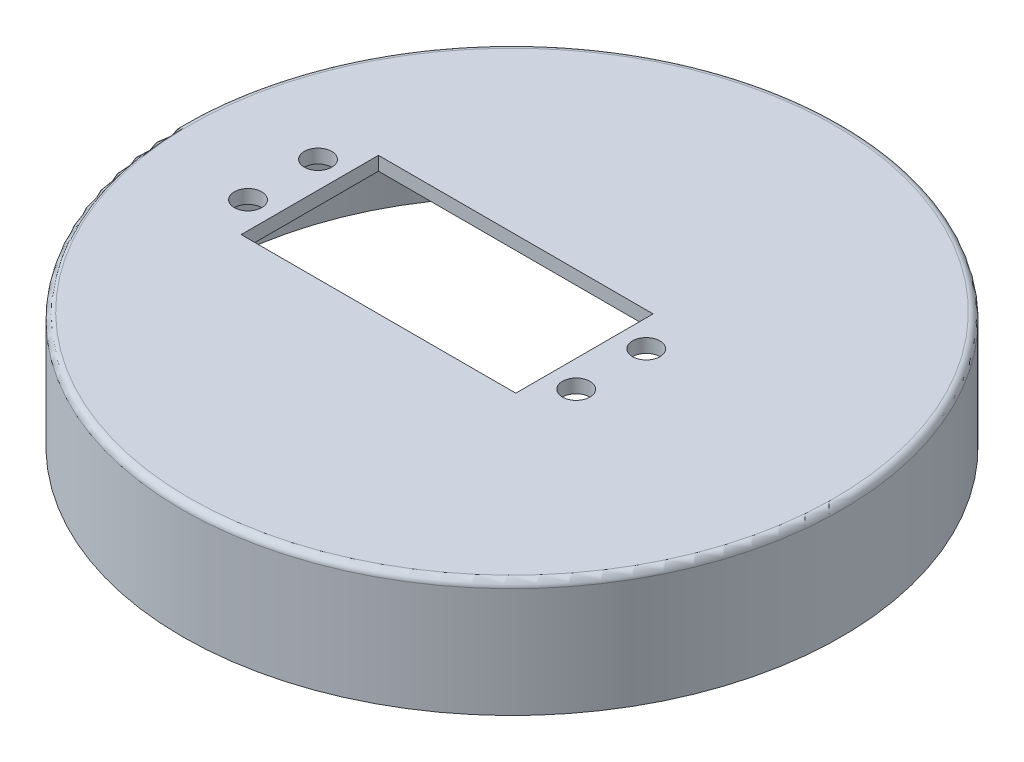
ISO-10303-21;
HEADER;
FILE_DESCRIPTION(('STEP AP214'),'2;1');
FILE_NAME('part.step','',(''),(''),'','','');
FILE_SCHEMA(('AUTOMOTIVE_DESIGN { 1 0 10303 214 1 1 1 1 }'));
ENDSEC;
DATA;
#1=APPLICATION_CONTEXT('core data for automotive mechanical design processes');
#2=APPLICATION_PROTOCOL_DEFINITION('international standard','automotive_design',2000,#1);
#3=PRODUCT_CONTEXT('',#1,'mechanical');
#4=PRODUCT('Part','Part','',(#3));
#5=PRODUCT_RELATED_PRODUCT_CATEGORY('part','',(#4));
#6=PRODUCT_DEFINITION_FORMATION('','',#4);
#7=PRODUCT_DEFINITION_CONTEXT('part definition',#1,'design');
#8=PRODUCT_DEFINITION('design','',#6,#7);
#9=PRODUCT_DEFINITION_SHAPE('','',#8);
#10=(LENGTH_UNIT() NAMED_UNIT(*) SI_UNIT(.MILLI.,.METRE.));
#11=(NAMED_UNIT(*) PLANE_ANGLE_UNIT() SI_UNIT($,.RADIAN.));
#12=(NAMED_UNIT(*) SI_UNIT($,.STERADIAN.) SOLID_ANGLE_UNIT());
#13=UNCERTAINTY_MEASURE_WITH_UNIT(LENGTH_MEASURE(1.E-05),#10,'distance_accuracy_value','');
#14=(GEOMETRIC_REPRESENTATION_CONTEXT(3) GLOBAL_UNCERTAINTY_ASSIGNED_CONTEXT((#13)) GLOBAL_UNIT_ASSIGNED_CONTEXT((#10,
#11,#12)) REPRESENTATION_CONTEXT('',''));
#15=CARTESIAN_POINT('',(0.,0.,0.));
#16=DIRECTION('',(0.,0.,1.));
#17=DIRECTION('',(1.,0.,0.));
#18=AXIS2_PLACEMENT_3D('',#15,#16,#17);
#19=CARTESIAN_POINT('',(0.,0.,0.));
#20=DIRECTION('',(0.,1.,0.));
#21=DIRECTION('',(0.,0.,1.));
#22=AXIS2_PLACEMENT_3D('',#19,#20,#21);
#23=PLANE('',#22);
#24=CARTESIAN_POINT('',(-33.3488657899991,0.,5.09860840999997));
#25=DIRECTION('',(0.,1.,0.));
#26=DIRECTION('',(0.,0.,1.));
#27=AXIS2_PLACEMENT_3D('',#24,#25,#26);
#28=CIRCLE('',#27,2.);
#29=CARTESIAN_POINT('',(-33.3488657899991,0.,7.09860840999997));
#30=VERTEX_POINT('',#29);
#31=EDGE_CURVE('E306',#30,#30,#28,.T.);
#32=ORIENTED_EDGE('',*,*,#31,.T.);
#33=EDGE_LOOP('',(#32));
#34=FACE_BOUND('',#33,.T.);
#35=CARTESIAN_POINT('',(-33.3488657899991,0.,-5.09860840999996));
#36=DIRECTION('',(0.,1.,0.));
#37=DIRECTION('',(0.,0.,1.));
#38=AXIS2_PLACEMENT_3D('',#35,#36,#37);
#39=CIRCLE('',#38,2.);
#40=CARTESIAN_POINT('',(-33.3488657899991,0.,-3.09860840999996));
#41=VERTEX_POINT('',#40);
#42=EDGE_CURVE('E308',#41,#41,#39,.F.);
#43=ORIENTED_EDGE('',*,*,#42,.F.);
#44=EDGE_LOOP('',(#43));
#45=FACE_BOUND('',#44,.T.);
#46=CARTESIAN_POINT('',(14.4488657899991,0.,5.09860840999996));
#47=DIRECTION('',(0.,1.,0.));
#48=DIRECTION('',(0.,0.,1.));
#49=AXIS2_PLACEMENT_3D('',#46,#47,#48);
#50=CIRCLE('',#49,2.);
#51=CARTESIAN_POINT('',(14.4488657899991,0.,7.09860840999997));
#52=VERTEX_POINT('',#51);
#53=EDGE_CURVE('E313',#52,#52,#50,.F.);
#54=ORIENTED_EDGE('',*,*,#53,.F.);
#55=EDGE_LOOP('',(#54));
#56=FACE_BOUND('',#55,.T.);
#57=CARTESIAN_POINT('',(0.,0.,0.));
#58=DIRECTION('',(0.,1.,0.));
#59=DIRECTION('',(0.,0.,1.));
#60=AXIS2_PLACEMENT_3D('',#57,#58,#59);
#61=CIRCLE('',#60,43.5);
#62=CARTESIAN_POINT('',(0.,0.,43.5));
#63=VERTEX_POINT('',#62);
#64=EDGE_CURVE('E134',#63,#63,#61,.F.);
#65=ORIENTED_EDGE('',*,*,#64,.T.);
#66=EDGE_LOOP('',(#65));
#67=FACE_BOUND('',#66,.T.);
#68=DIRECTION('',(1.,0.,0.));
#69=VECTOR('',#68,1.);
#70=CARTESIAN_POINT('',(0.,0.,-10.));
#71=LINE('',#70,#69);
#72=CARTESIAN_POINT('',(-29.45,0.,-10.));
#73=VERTEX_POINT('',#72);
#74=CARTESIAN_POINT('',(10.55,0.,-10.));
#75=VERTEX_POINT('',#74);
#76=EDGE_CURVE('E123',#73,#75,#71,.T.);
#77=ORIENTED_EDGE('',*,*,#76,.F.);
#78=DIRECTION('',(0.,0.,1.));
#79=VECTOR('',#78,1.);
#80=CARTESIAN_POINT('',(-29.45,0.,0.));
#81=LINE('',#80,#79);
#82=CARTESIAN_POINT('',(-29.45,0.,10.));
#83=VERTEX_POINT('',#82);
#84=EDGE_CURVE('E115',#73,#83,#81,.T.);
#85=ORIENTED_EDGE('',*,*,#84,.T.);
#86=DIRECTION('',(1.,0.,0.));
#87=VECTOR('',#86,1.);
#88=CARTESIAN_POINT('',(0.,0.,10.));
#89=LINE('',#88,#87);
#90=CARTESIAN_POINT('',(10.55,0.,10.));
#91=VERTEX_POINT('',#90);
#92=EDGE_CURVE('E95',#83,#91,#89,.T.);
#93=ORIENTED_EDGE('',*,*,#92,.T.);
#94=DIRECTION('',(0.,0.,-1.));
#95=VECTOR('',#94,1.);
#96=CARTESIAN_POINT('',(10.55,0.,0.));
#97=LINE('',#96,#95);
#98=EDGE_CURVE('E120',#91,#75,#97,.T.);
#99=ORIENTED_EDGE('',*,*,#98,.T.);
#100=EDGE_LOOP('',(#77,#85,#93,#99));
#101=FACE_BOUND('',#100,.T.);
#102=CARTESIAN_POINT('',(14.4488657899991,0.,-5.09860840999996));
#103=DIRECTION('',(0.,1.,0.));
#104=DIRECTION('',(0.,0.,1.));
#105=AXIS2_PLACEMENT_3D('',#102,#103,#104);
#106=CIRCLE('',#105,2.);
#107=CARTESIAN_POINT('',(14.4488657899991,0.,-3.09860840999995));
#108=VERTEX_POINT('',#107);
#109=EDGE_CURVE('E304',#108,#108,#106,.T.);
#110=ORIENTED_EDGE('',*,*,#109,.T.);
#111=EDGE_LOOP('',(#110));
#112=FACE_BOUND('',#111,.T.);
#113=ADVANCED_FACE('F48',(#34,#45,#56,#67,#101,#112),#23,.F.);
#114=CARTESIAN_POINT('',(0.,2.,0.));
#115=DIRECTION('',(0.,1.,0.));
#116=DIRECTION('',(0.,0.,1.));
#117=AXIS2_PLACEMENT_3D('',#114,#115,#116);
#118=PLANE('',#117);
#119=CARTESIAN_POINT('',(-33.3488657899991,2.,-5.09860840999996));
#120=DIRECTION('',(0.,1.,0.));
#121=DIRECTION('',(0.,0.,1.));
#122=AXIS2_PLACEMENT_3D('',#119,#120,#121);
#123=CIRCLE('',#122,2.);
#124=CARTESIAN_POINT('',(-33.3488657899991,2.,-3.09860840999996));
#125=VERTEX_POINT('',#124);
#126=EDGE_CURVE('E322',#125,#125,#123,.F.);
#127=ORIENTED_EDGE('',*,*,#126,.T.);
#128=EDGE_LOOP('',(#127));
#129=FACE_BOUND('',#128,.T.);
#130=CARTESIAN_POINT('',(14.4488657899991,2.,5.09860840999996));
#131=DIRECTION('',(0.,1.,0.));
#132=DIRECTION('',(0.,0.,1.));
#133=AXIS2_PLACEMENT_3D('',#130,#131,#132);
#134=CIRCLE('',#133,2.);
#135=CARTESIAN_POINT('',(14.4488657899991,2.,7.09860840999997));
#136=VERTEX_POINT('',#135);
#137=EDGE_CURVE('E316',#136,#136,#134,.F.);
#138=ORIENTED_EDGE('',*,*,#137,.T.);
#139=EDGE_LOOP('',(#138));
#140=FACE_BOUND('',#139,.T.);
#141=CARTESIAN_POINT('',(0.,2.,0.));
#142=DIRECTION('',(0.,1.,0.));
#143=DIRECTION('',(0.,0.,1.));
#144=AXIS2_PLACEMENT_3D('',#141,#142,#143);
#145=CIRCLE('',#144,47.);
#146=CARTESIAN_POINT('',(0.,2.,47.));
#147=VERTEX_POINT('',#146);
#148=EDGE_CURVE('E56',#147,#147,#145,.T.);
#149=ORIENTED_EDGE('',*,*,#148,.T.);
#150=EDGE_LOOP('',(#149));
#151=FACE_BOUND('',#150,.T.);
#152=DIRECTION('',(0.,0.,1.));
#153=VECTOR('',#152,1.);
#154=CARTESIAN_POINT('',(-29.45,2.,0.));
#155=LINE('',#154,#153);
#156=CARTESIAN_POINT('',(-29.45,2.,-10.));
#157=VERTEX_POINT('',#156);
#158=CARTESIAN_POINT('',(-29.45,2.,10.));
#159=VERTEX_POINT('',#158);
#160=EDGE_CURVE('E101',#157,#159,#155,.T.);
#161=ORIENTED_EDGE('',*,*,#160,.F.);
#162=DIRECTION('',(1.,0.,0.));
#163=VECTOR('',#162,1.);
#164=CARTESIAN_POINT('',(0.,2.,-10.));
#165=LINE('',#164,#163);
#166=CARTESIAN_POINT('',(10.55,2.,-10.));
#167=VERTEX_POINT('',#166);
#168=EDGE_CURVE('E71',#157,#167,#165,.T.);
#169=ORIENTED_EDGE('',*,*,#168,.T.);
#170=DIRECTION('',(0.,0.,-1.));
#171=VECTOR('',#170,1.);
#172=CARTESIAN_POINT('',(10.55,2.,0.));
#173=LINE('',#172,#171);
#174=CARTESIAN_POINT('',(10.55,2.,10.));
#175=VERTEX_POINT('',#174);
#176=EDGE_CURVE('E108',#175,#167,#173,.T.);
#177=ORIENTED_EDGE('',*,*,#176,.F.);
#178=DIRECTION('',(1.,0.,0.));
#179=VECTOR('',#178,1.);
#180=CARTESIAN_POINT('',(0.,2.,10.));
#181=LINE('',#180,#179);
#182=EDGE_CURVE('E92',#159,#175,#181,.T.);
#183=ORIENTED_EDGE('',*,*,#182,.F.);
#184=EDGE_LOOP('',(#161,#169,#177,#183));
#185=FACE_BOUND('',#184,.T.);
#186=CARTESIAN_POINT('',(-33.3488657899991,2.,5.09860840999997));
#187=DIRECTION('',(0.,1.,0.));
#188=DIRECTION('',(0.,0.,1.));
#189=AXIS2_PLACEMENT_3D('',#186,#187,#188);
#190=CIRCLE('',#189,2.);
#191=CARTESIAN_POINT('',(-33.3488657899991,2.,7.09860840999997));
#192=VERTEX_POINT('',#191);
#193=EDGE_CURVE('E319',#192,#192,#190,.T.);
#194=ORIENTED_EDGE('',*,*,#193,.F.);
#195=EDGE_LOOP('',(#194));
#196=FACE_BOUND('',#195,.T.);
#197=CARTESIAN_POINT('',(14.4488657899991,2.,-5.09860840999996));
#198=DIRECTION('',(0.,1.,0.));
#199=DIRECTION('',(0.,0.,1.));
#200=AXIS2_PLACEMENT_3D('',#197,#198,#199);
#201=CIRCLE('',#200,2.);
#202=CARTESIAN_POINT('',(14.4488657899991,2.,-3.09860840999995));
#203=VERTEX_POINT('',#202);
#204=EDGE_CURVE('E301',#203,#203,#201,.T.);
#205=ORIENTED_EDGE('',*,*,#204,.F.);
#206=EDGE_LOOP('',(#205));
#207=FACE_BOUND('',#206,.T.);
#208=ADVANCED_FACE('F105',(#129,#140,#151,#185,#196,#207),#118,.T.);
#209=CARTESIAN_POINT('',(0.,-15.,0.));
#210=DIRECTION('',(0.,1.,0.));
#211=DIRECTION('',(0.,0.,1.));
#212=AXIS2_PLACEMENT_3D('',#209,#210,#211);
#213=CYLINDRICAL_SURFACE('',#212,48.);
#214=CARTESIAN_POINT('',(0.,1.,0.));
#215=DIRECTION('',(0.,1.,0.));
#216=DIRECTION('',(0.,0.,1.));
#217=AXIS2_PLACEMENT_3D('',#214,#215,#216);
#218=CIRCLE('',#217,48.);
#219=CARTESIAN_POINT('',(0.,1.,48.));
#220=VERTEX_POINT('',#219);
#221=EDGE_CURVE('E12',#220,#220,#218,.F.);
#222=ORIENTED_EDGE('',*,*,#221,.T.);
#223=EDGE_LOOP('',(#222));
#224=FACE_BOUND('',#223,.T.);
#225=CARTESIAN_POINT('',(0.,-15.,0.));
#226=DIRECTION('',(0.,1.,0.));
#227=DIRECTION('',(0.,0.,1.));
#228=AXIS2_PLACEMENT_3D('',#225,#226,#227);
#229=CIRCLE('',#228,48.);
#230=CARTESIAN_POINT('',(0.,-15.,48.));
#231=VERTEX_POINT('',#230);
#232=EDGE_CURVE('E128',#231,#231,#229,.T.);
#233=ORIENTED_EDGE('',*,*,#232,.T.);
#234=EDGE_LOOP('',(#233));
#235=FACE_BOUND('',#234,.T.);
#236=ADVANCED_FACE('F159',(#224,#235),#213,.T.);
#237=CARTESIAN_POINT('',(0.,-15.,0.));
#238=DIRECTION('',(0.,1.,0.));
#239=DIRECTION('',(0.,0.,1.));
#240=AXIS2_PLACEMENT_3D('',#237,#238,#239);
#241=PLANE('',#240);
#242=CARTESIAN_POINT('',(0.,-15.,0.));
#243=DIRECTION('',(0.,1.,0.));
#244=DIRECTION('',(0.,0.,1.));
#245=AXIS2_PLACEMENT_3D('',#242,#243,#244);
#246=CIRCLE('',#245,44.5);
#247=CARTESIAN_POINT('',(0.,-15.,44.5));
#248=VERTEX_POINT('',#247);
#249=EDGE_CURVE('E125',#248,#248,#246,.T.);
#250=ORIENTED_EDGE('',*,*,#249,.T.);
#251=EDGE_LOOP('',(#250));
#252=FACE_BOUND('',#251,.T.);
#253=ORIENTED_EDGE('',*,*,#232,.F.);
#254=EDGE_LOOP('',(#253));
#255=FACE_BOUND('',#254,.T.);
#256=ADVANCED_FACE('F167',(#252,#255),#241,.F.);
#257=CARTESIAN_POINT('',(0.,-15.,0.));
#258=DIRECTION('',(0.,1.,0.));
#259=DIRECTION('',(0.,0.,1.));
#260=AXIS2_PLACEMENT_3D('',#257,#258,#259);
#261=CYLINDRICAL_SURFACE('',#260,44.5);
#262=CARTESIAN_POINT('',(0.,-1.,0.));
#263=DIRECTION('',(0.,1.,0.));
#264=DIRECTION('',(0.,0.,1.));
#265=AXIS2_PLACEMENT_3D('',#262,#263,#264);
#266=CIRCLE('',#265,44.5);
#267=CARTESIAN_POINT('',(0.,-1.,44.5));
#268=VERTEX_POINT('',#267);
#269=EDGE_CURVE('E131',#268,#268,#266,.T.);
#270=ORIENTED_EDGE('',*,*,#269,.T.);
#271=EDGE_LOOP('',(#270));
#272=FACE_BOUND('',#271,.T.);
#273=ORIENTED_EDGE('',*,*,#249,.F.);
#274=EDGE_LOOP('',(#273));
#275=FACE_BOUND('',#274,.T.);
#276=ADVANCED_FACE('F150',(#272,#275),#261,.F.);
#277=CARTESIAN_POINT('',(0.,-1.,0.));
#278=DIRECTION('',(0.,1.,0.));
#279=DIRECTION('',(0.,0.,1.));
#280=AXIS2_PLACEMENT_3D('',#277,#278,#279);
#281=TOROIDAL_SURFACE('',#280,43.5,1.);
#282=ORIENTED_EDGE('',*,*,#64,.F.);
#283=EDGE_LOOP('',(#282));
#284=FACE_BOUND('',#283,.T.);
#285=ORIENTED_EDGE('',*,*,#269,.F.);
#286=EDGE_LOOP('',(#285));
#287=FACE_BOUND('',#286,.T.);
#288=ADVANCED_FACE('F142',(#284,#287),#281,.F.);
#289=CARTESIAN_POINT('',(0.,1.,0.));
#290=DIRECTION('',(0.,1.,0.));
#291=DIRECTION('',(0.,0.,1.));
#292=AXIS2_PLACEMENT_3D('',#289,#290,#291);
#293=TOROIDAL_SURFACE('',#292,47.,1.);
#294=ORIENTED_EDGE('',*,*,#221,.F.);
#295=EDGE_LOOP('',(#294));
#296=FACE_BOUND('',#295,.T.);
#297=ORIENTED_EDGE('',*,*,#148,.F.);
#298=EDGE_LOOP('',(#297));
#299=FACE_BOUND('',#298,.T.);
#300=ADVANCED_FACE('F50',(#296,#299),#293,.T.);
#301=CARTESIAN_POINT('',(0.,-28.,-10.));
#302=DIRECTION('',(0.,0.,1.));
#303=DIRECTION('',(1.,0.,0.));
#304=AXIS2_PLACEMENT_3D('',#301,#302,#303);
#305=PLANE('',#304);
#306=ORIENTED_EDGE('',*,*,#76,.T.);
#307=DIRECTION('',(0.,1.,0.));
#308=VECTOR('',#307,1.);
#309=CARTESIAN_POINT('',(10.55,-28.,-10.));
#310=LINE('',#309,#308);
#311=EDGE_CURVE('E113',#75,#167,#310,.T.);
#312=ORIENTED_EDGE('',*,*,#311,.T.);
#313=ORIENTED_EDGE('',*,*,#168,.F.);
#314=DIRECTION('',(0.,1.,0.));
#315=VECTOR('',#314,1.);
#316=CARTESIAN_POINT('',(-29.45,-28.,-10.));
#317=LINE('',#316,#315);
#318=EDGE_CURVE('E98',#73,#157,#317,.T.);
#319=ORIENTED_EDGE('',*,*,#318,.F.);
#320=EDGE_LOOP('',(#306,#312,#313,#319));
#321=FACE_BOUND('',#320,.T.);
#322=ADVANCED_FACE('F141',(#321),#305,.T.);
#323=CARTESIAN_POINT('',(10.55,-28.,0.));
#324=DIRECTION('',(1.,0.,0.));
#325=DIRECTION('',(0.,0.,-1.));
#326=AXIS2_PLACEMENT_3D('',#323,#324,#325);
#327=PLANE('',#326);
#328=DIRECTION('',(0.,1.,0.));
#329=VECTOR('',#328,1.);
#330=CARTESIAN_POINT('',(10.55,-28.,10.));
#331=LINE('',#330,#329);
#332=EDGE_CURVE('E97',#91,#175,#331,.T.);
#333=ORIENTED_EDGE('',*,*,#332,.T.);
#334=ORIENTED_EDGE('',*,*,#176,.T.);
#335=ORIENTED_EDGE('',*,*,#311,.F.);
#336=ORIENTED_EDGE('',*,*,#98,.F.);
#337=EDGE_LOOP('',(#333,#334,#335,#336));
#338=FACE_BOUND('',#337,.T.);
#339=ADVANCED_FACE('F148',(#338),#327,.F.);
#340=CARTESIAN_POINT('',(0.,-28.,10.));
#341=DIRECTION('',(0.,0.,1.));
#342=DIRECTION('',(1.,0.,0.));
#343=AXIS2_PLACEMENT_3D('',#340,#341,#342);
#344=PLANE('',#343);
#345=DIRECTION('',(0.,1.,0.));
#346=VECTOR('',#345,1.);
#347=CARTESIAN_POINT('',(-29.45,-28.,10.));
#348=LINE('',#347,#346);
#349=EDGE_CURVE('E63',#83,#159,#348,.T.);
#350=ORIENTED_EDGE('',*,*,#349,.T.);
#351=ORIENTED_EDGE('',*,*,#182,.T.);
#352=ORIENTED_EDGE('',*,*,#332,.F.);
#353=ORIENTED_EDGE('',*,*,#92,.F.);
#354=EDGE_LOOP('',(#350,#351,#352,#353));
#355=FACE_BOUND('',#354,.T.);
#356=ADVANCED_FACE('F89',(#355),#344,.F.);
#357=CARTESIAN_POINT('',(-29.45,-28.,0.));
#358=DIRECTION('',(-1.,0.,0.));
#359=DIRECTION('',(0.,0.,1.));
#360=AXIS2_PLACEMENT_3D('',#357,#358,#359);
#361=PLANE('',#360);
#362=ORIENTED_EDGE('',*,*,#318,.T.);
#363=ORIENTED_EDGE('',*,*,#160,.T.);
#364=ORIENTED_EDGE('',*,*,#349,.F.);
#365=ORIENTED_EDGE('',*,*,#84,.F.);
#366=EDGE_LOOP('',(#362,#363,#364,#365));
#367=FACE_BOUND('',#366,.T.);
#368=ADVANCED_FACE('F102',(#367),#361,.F.);
#369=CARTESIAN_POINT('',(14.4488657899991,-8.,5.09860840999996));
#370=DIRECTION('',(0.,1.,0.));
#371=DIRECTION('',(0.,0.,1.));
#372=AXIS2_PLACEMENT_3D('',#369,#370,#371);
#373=CYLINDRICAL_SURFACE('',#372,2.);
#374=ORIENTED_EDGE('',*,*,#137,.F.);
#375=EDGE_LOOP('',(#374));
#376=FACE_BOUND('',#375,.T.);
#377=ORIENTED_EDGE('',*,*,#53,.T.);
#378=EDGE_LOOP('',(#377));
#379=FACE_BOUND('',#378,.T.);
#380=ADVANCED_FACE('F235',(#376,#379),#373,.F.);
#381=CARTESIAN_POINT('',(-33.3488657899991,-8.,-5.09860840999996));
#382=DIRECTION('',(0.,1.,0.));
#383=DIRECTION('',(0.,0.,1.));
#384=AXIS2_PLACEMENT_3D('',#381,#382,#383);
#385=CYLINDRICAL_SURFACE('',#384,2.);
#386=ORIENTED_EDGE('',*,*,#126,.F.);
#387=EDGE_LOOP('',(#386));
#388=FACE_BOUND('',#387,.T.);
#389=ORIENTED_EDGE('',*,*,#42,.T.);
#390=EDGE_LOOP('',(#389));
#391=FACE_BOUND('',#390,.T.);
#392=ADVANCED_FACE('F257',(#388,#391),#385,.F.);
#393=CARTESIAN_POINT('',(-33.3488657899991,-8.,5.09860840999997));
#394=DIRECTION('',(0.,1.,0.));
#395=DIRECTION('',(0.,0.,1.));
#396=AXIS2_PLACEMENT_3D('',#393,#394,#395);
#397=CYLINDRICAL_SURFACE('',#396,2.);
#398=ORIENTED_EDGE('',*,*,#193,.T.);
#399=EDGE_LOOP('',(#398));
#400=FACE_BOUND('',#399,.T.);
#401=ORIENTED_EDGE('',*,*,#31,.F.);
#402=EDGE_LOOP('',(#401));
#403=FACE_BOUND('',#402,.T.);
#404=ADVANCED_FACE('F267',(#400,#403),#397,.F.);
#405=CARTESIAN_POINT('',(14.4488657899991,-8.,-5.09860840999996));
#406=DIRECTION('',(0.,1.,0.));
#407=DIRECTION('',(0.,0.,1.));
#408=AXIS2_PLACEMENT_3D('',#405,#406,#407);
#409=CYLINDRICAL_SURFACE('',#408,2.);
#410=ORIENTED_EDGE('',*,*,#204,.T.);
#411=EDGE_LOOP('',(#410));
#412=FACE_BOUND('',#411,.T.);
#413=ORIENTED_EDGE('',*,*,#109,.F.);
#414=EDGE_LOOP('',(#413));
#415=FACE_BOUND('',#414,.T.);
#416=ADVANCED_FACE('F278',(#412,#415),#409,.F.);
#417=CLOSED_SHELL('',(#113,#208,#236,#256,#276,#288,#300,#322,#339,#356,#368,#380,#392,#404,#416));
#418=MANIFOLD_SOLID_BREP('B2',#417);
#419=ADVANCED_BREP_SHAPE_REPRESENTATION('',(#18,#418),#14);
#420=SHAPE_DEFINITION_REPRESENTATION(#9,#419);
ENDSEC;
END-ISO-10303-21;
